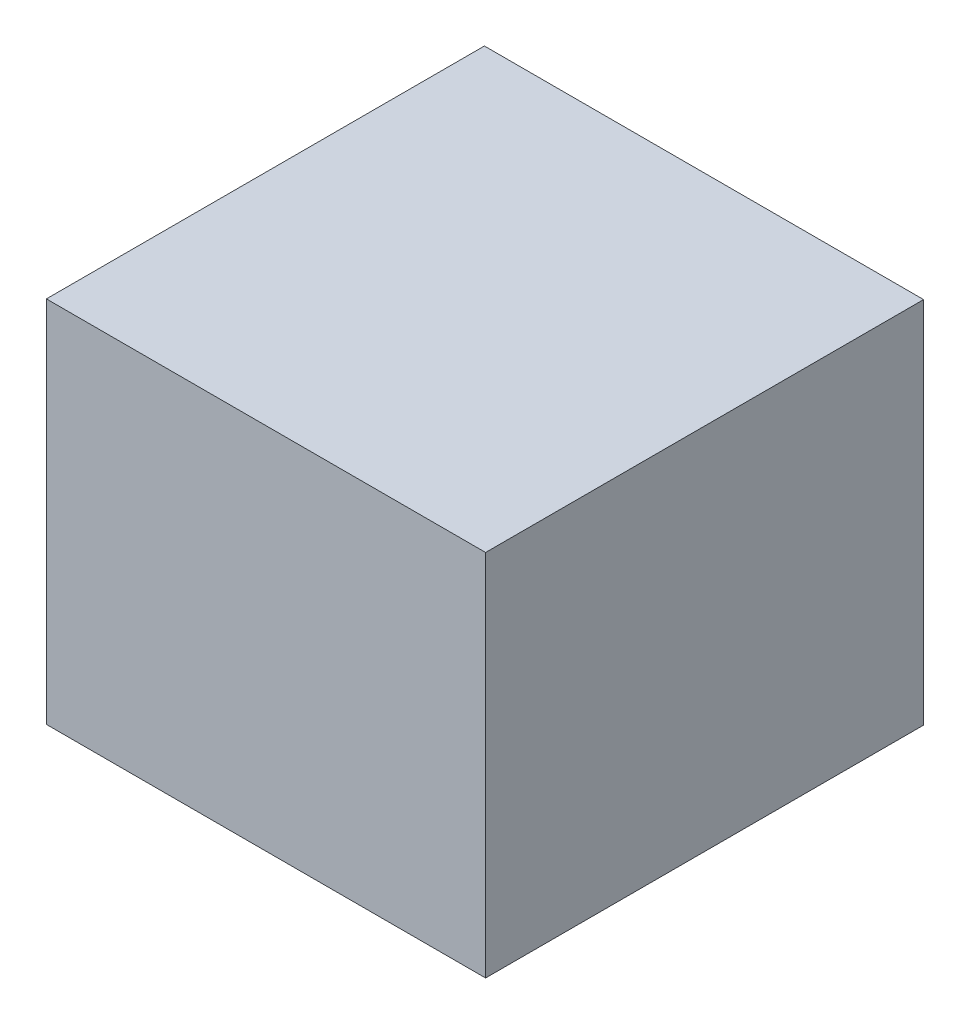
ISO-10303-21;
HEADER;
FILE_DESCRIPTION(('STEP AP214'),'2;1');
FILE_NAME('part.step','',(''),(''),'','','');
FILE_SCHEMA(('AUTOMOTIVE_DESIGN { 1 0 10303 214 1 1 1 1 }'));
ENDSEC;
DATA;
#1=APPLICATION_CONTEXT('core data for automotive mechanical design processes');
#2=APPLICATION_PROTOCOL_DEFINITION('international standard','automotive_design',2000,#1);
#3=PRODUCT_CONTEXT('',#1,'mechanical');
#4=PRODUCT('Part','Part','',(#3));
#5=PRODUCT_RELATED_PRODUCT_CATEGORY('part','',(#4));
#6=PRODUCT_DEFINITION_FORMATION('','',#4);
#7=PRODUCT_DEFINITION_CONTEXT('part definition',#1,'design');
#8=PRODUCT_DEFINITION('design','',#6,#7);
#9=PRODUCT_DEFINITION_SHAPE('','',#8);
#10=(LENGTH_UNIT() NAMED_UNIT(*) SI_UNIT(.MILLI.,.METRE.));
#11=(NAMED_UNIT(*) PLANE_ANGLE_UNIT() SI_UNIT($,.RADIAN.));
#12=(NAMED_UNIT(*) SI_UNIT($,.STERADIAN.) SOLID_ANGLE_UNIT());
#13=UNCERTAINTY_MEASURE_WITH_UNIT(LENGTH_MEASURE(1.E-05),#10,'distance_accuracy_value','');
#14=(GEOMETRIC_REPRESENTATION_CONTEXT(3) GLOBAL_UNCERTAINTY_ASSIGNED_CONTEXT((#13)) GLOBAL_UNIT_ASSIGNED_CONTEXT((#10,
#11,#12)) REPRESENTATION_CONTEXT('',''));
#15=CARTESIAN_POINT('',(0.,0.,0.));
#16=DIRECTION('',(0.,0.,1.));
#17=DIRECTION('',(1.,0.,0.));
#18=AXIS2_PLACEMENT_3D('',#15,#16,#17);
#19=CARTESIAN_POINT('',(3.452820090798E-07,1.904995948718E-06,0.5999988));
#20=DIRECTION('',(0.,0.,-1.));
#21=DIRECTION('',(0.,-1.,0.));
#22=AXIS2_PLACEMENT_3D('',#19,#20,#21);
#23=PLANE('',#22);
#24=DIRECTION('',(0.999999999991088,-4.22177841412937E-06,0.));
#25=VECTOR('',#24,1.);
#26=CARTESIAN_POINT('',(-0.30082236,0.25241504,0.5999988));
#27=LINE('',#26,#25);
#28=CARTESIAN_POINT('',(-0.30082236,0.25241504,0.5999988));
#29=VERTEX_POINT('',#28);
#30=CARTESIAN_POINT('',(0.30081982,0.2524125,0.5999988));
#31=VERTEX_POINT('',#30);
#32=EDGE_CURVE('E19',#29,#31,#27,.T.);
#33=ORIENTED_EDGE('',*,*,#32,.F.);
#34=DIRECTION('',(-5.03147179415472E-06,0.999999999987342,0.));
#35=VECTOR('',#34,1.);
#36=CARTESIAN_POINT('',(-0.30081982,-0.25240742,0.5999988));
#37=LINE('',#36,#35);
#38=CARTESIAN_POINT('',(-0.30081982,-0.25240742,0.5999988));
#39=VERTEX_POINT('',#38);
#40=EDGE_CURVE('E26',#39,#29,#37,.T.);
#41=ORIENTED_EDGE('',*,*,#40,.F.);
#42=DIRECTION('',(-0.999999999964353,8.44355692251798E-06,0.));
#43=VECTOR('',#42,1.);
#44=CARTESIAN_POINT('',(0.30082236,-0.2524125,0.5999988));
#45=LINE('',#44,#43);
#46=CARTESIAN_POINT('',(0.30082236,-0.2524125,0.5999988));
#47=VERTEX_POINT('',#46);
#48=EDGE_CURVE('E69',#47,#39,#45,.T.);
#49=ORIENTED_EDGE('',*,*,#48,.F.);
#50=DIRECTION('',(5.03144659117372E-06,-0.999999999987342,0.));
#51=VECTOR('',#50,1.);
#52=CARTESIAN_POINT('',(0.30081982,0.2524125,0.5999988));
#53=LINE('',#52,#51);
#54=EDGE_CURVE('E92',#31,#47,#53,.T.);
#55=ORIENTED_EDGE('',*,*,#54,.F.);
#56=EDGE_LOOP('',(#33,#41,#49,#55));
#57=FACE_BOUND('',#56,.T.);
#58=ADVANCED_FACE('F16',(#57),#23,.F.);
#59=CARTESIAN_POINT('',(3.452820090798E-07,1.904995948718E-06,0.));
#60=DIRECTION('',(0.,0.,-1.));
#61=DIRECTION('',(0.,-1.,0.));
#62=AXIS2_PLACEMENT_3D('',#59,#60,#61);
#63=PLANE('',#62);
#64=DIRECTION('',(0.999999999991088,-4.22177841412937E-06,0.));
#65=VECTOR('',#64,1.);
#66=CARTESIAN_POINT('',(-0.30082236,0.25241504,0.));
#67=LINE('',#66,#65);
#68=CARTESIAN_POINT('',(-0.30082236,0.25241504,0.));
#69=VERTEX_POINT('',#68);
#70=CARTESIAN_POINT('',(0.30081982,0.2524125,0.));
#71=VERTEX_POINT('',#70);
#72=EDGE_CURVE('E87',#69,#71,#67,.T.);
#73=ORIENTED_EDGE('',*,*,#72,.T.);
#74=DIRECTION('',(5.03144659117372E-06,-0.999999999987342,0.));
#75=VECTOR('',#74,1.);
#76=CARTESIAN_POINT('',(0.30081982,0.2524125,0.));
#77=LINE('',#76,#75);
#78=CARTESIAN_POINT('',(0.30082236,-0.2524125,0.));
#79=VERTEX_POINT('',#78);
#80=EDGE_CURVE('E75',#71,#79,#77,.T.);
#81=ORIENTED_EDGE('',*,*,#80,.T.);
#82=DIRECTION('',(-0.999999999964353,8.44355692251798E-06,0.));
#83=VECTOR('',#82,1.);
#84=CARTESIAN_POINT('',(0.30082236,-0.2524125,0.));
#85=LINE('',#84,#83);
#86=CARTESIAN_POINT('',(-0.30081982,-0.25240742,0.));
#87=VERTEX_POINT('',#86);
#88=EDGE_CURVE('E61',#79,#87,#85,.T.);
#89=ORIENTED_EDGE('',*,*,#88,.T.);
#90=DIRECTION('',(-5.03147179415472E-06,0.999999999987342,0.));
#91=VECTOR('',#90,1.);
#92=CARTESIAN_POINT('',(-0.30081982,-0.25240742,0.));
#93=LINE('',#92,#91);
#94=EDGE_CURVE('E11',#87,#69,#93,.T.);
#95=ORIENTED_EDGE('',*,*,#94,.T.);
#96=EDGE_LOOP('',(#73,#81,#89,#95));
#97=FACE_BOUND('',#96,.T.);
#98=ADVANCED_FACE('F88',(#97),#63,.T.);
#99=CARTESIAN_POINT('',(-0.30081982,-0.25240742,0.));
#100=DIRECTION('',(-0.999999999987342,-5.03147179415472E-06,0.));
#101=DIRECTION('',(-5.03147179415472E-06,0.999999999987342,0.));
#102=AXIS2_PLACEMENT_3D('',#99,#100,#101);
#103=PLANE('',#102);
#104=DIRECTION('',(0.,0.,1.));
#105=VECTOR('',#104,1.);
#106=CARTESIAN_POINT('',(-0.30081982,-0.25240742,0.));
#107=LINE('',#106,#105);
#108=EDGE_CURVE('E111',#87,#39,#107,.T.);
#109=ORIENTED_EDGE('',*,*,#108,.T.);
#110=ORIENTED_EDGE('',*,*,#40,.T.);
#111=DIRECTION('',(0.,0.,1.));
#112=VECTOR('',#111,1.);
#113=CARTESIAN_POINT('',(-0.30082236,0.25241504,0.));
#114=LINE('',#113,#112);
#115=EDGE_CURVE('E102',#69,#29,#114,.T.);
#116=ORIENTED_EDGE('',*,*,#115,.F.);
#117=ORIENTED_EDGE('',*,*,#94,.F.);
#118=EDGE_LOOP('',(#109,#110,#116,#117));
#119=FACE_BOUND('',#118,.T.);
#120=ADVANCED_FACE('F126',(#119),#103,.T.);
#121=CARTESIAN_POINT('',(0.30082236,-0.2524125,0.));
#122=DIRECTION('',(-8.44355692251798E-06,-0.999999999964353,0.));
#123=DIRECTION('',(-0.999999999964353,8.44355692251798E-06,0.));
#124=AXIS2_PLACEMENT_3D('',#121,#122,#123);
#125=PLANE('',#124);
#126=DIRECTION('',(0.,0.,1.));
#127=VECTOR('',#126,1.);
#128=CARTESIAN_POINT('',(0.30082236,-0.2524125,0.));
#129=LINE('',#128,#127);
#130=EDGE_CURVE('E82',#79,#47,#129,.T.);
#131=ORIENTED_EDGE('',*,*,#130,.T.);
#132=ORIENTED_EDGE('',*,*,#48,.T.);
#133=ORIENTED_EDGE('',*,*,#108,.F.);
#134=ORIENTED_EDGE('',*,*,#88,.F.);
#135=EDGE_LOOP('',(#131,#132,#133,#134));
#136=FACE_BOUND('',#135,.T.);
#137=ADVANCED_FACE('F125',(#136),#125,.T.);
#138=CARTESIAN_POINT('',(0.30081982,0.2524125,0.));
#139=DIRECTION('',(0.999999999987342,5.03144659117372E-06,0.));
#140=DIRECTION('',(0.,0.,-1.));
#141=AXIS2_PLACEMENT_3D('',#138,#139,#140);
#142=PLANE('',#141);
#143=DIRECTION('',(0.,0.,1.));
#144=VECTOR('',#143,1.);
#145=CARTESIAN_POINT('',(0.30081982,0.2524125,0.));
#146=LINE('',#145,#144);
#147=EDGE_CURVE('E80',#71,#31,#146,.T.);
#148=ORIENTED_EDGE('',*,*,#147,.T.);
#149=ORIENTED_EDGE('',*,*,#54,.T.);
#150=ORIENTED_EDGE('',*,*,#130,.F.);
#151=ORIENTED_EDGE('',*,*,#80,.F.);
#152=EDGE_LOOP('',(#148,#149,#150,#151));
#153=FACE_BOUND('',#152,.T.);
#154=ADVANCED_FACE('F77',(#153),#142,.T.);
#155=CARTESIAN_POINT('',(-0.30082236,0.25241504,0.));
#156=DIRECTION('',(4.22177841412937E-06,0.999999999991088,0.));
#157=DIRECTION('',(0.,0.,-1.));
#158=AXIS2_PLACEMENT_3D('',#155,#156,#157);
#159=PLANE('',#158);
#160=ORIENTED_EDGE('',*,*,#115,.T.);
#161=ORIENTED_EDGE('',*,*,#32,.T.);
#162=ORIENTED_EDGE('',*,*,#147,.F.);
#163=ORIENTED_EDGE('',*,*,#72,.F.);
#164=EDGE_LOOP('',(#160,#161,#162,#163));
#165=FACE_BOUND('',#164,.T.);
#166=ADVANCED_FACE('F94',(#165),#159,.T.);
#167=CLOSED_SHELL('',(#58,#98,#120,#137,#154,#166));
#168=MANIFOLD_SOLID_BREP('B1',#167);
#169=ADVANCED_BREP_SHAPE_REPRESENTATION('',(#18,#168),#14);
#170=SHAPE_DEFINITION_REPRESENTATION(#9,#169);
ENDSEC;
END-ISO-10303-21;
